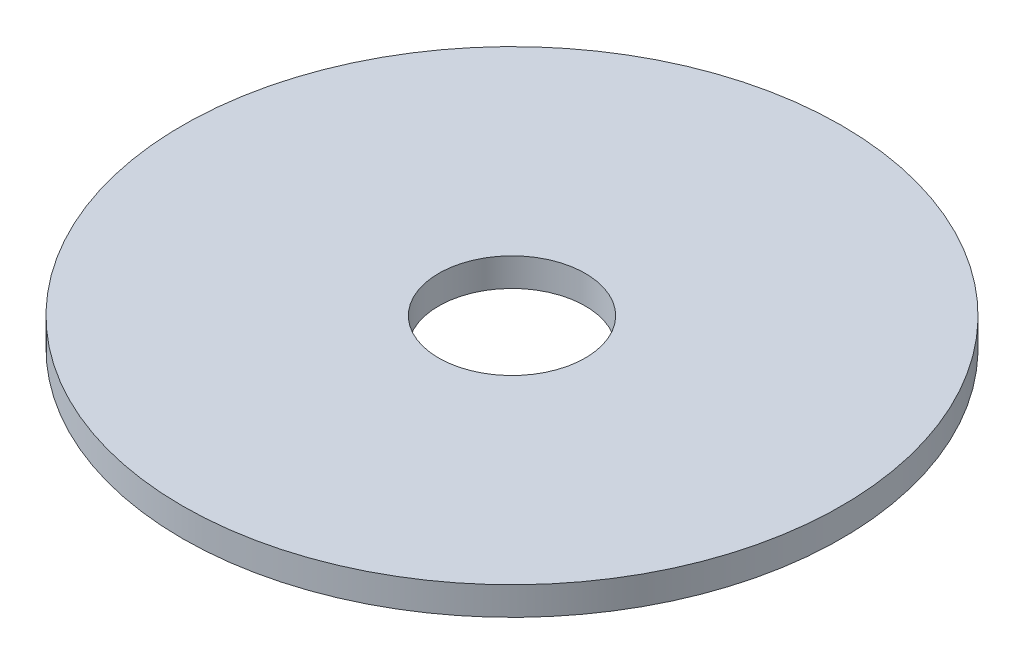
ISO-10303-21;
HEADER;
FILE_DESCRIPTION(('STEP AP214'),'2;1');
FILE_NAME('part.step','',(''),(''),'','','');
FILE_SCHEMA(('AUTOMOTIVE_DESIGN { 1 0 10303 214 1 1 1 1 }'));
ENDSEC;
DATA;
#1=APPLICATION_CONTEXT('core data for automotive mechanical design processes');
#2=APPLICATION_PROTOCOL_DEFINITION('international standard','automotive_design',2000,#1);
#3=PRODUCT_CONTEXT('',#1,'mechanical');
#4=PRODUCT('Part','Part','',(#3));
#5=PRODUCT_RELATED_PRODUCT_CATEGORY('part','',(#4));
#6=PRODUCT_DEFINITION_FORMATION('','',#4);
#7=PRODUCT_DEFINITION_CONTEXT('part definition',#1,'design');
#8=PRODUCT_DEFINITION('design','',#6,#7);
#9=PRODUCT_DEFINITION_SHAPE('','',#8);
#10=(LENGTH_UNIT() NAMED_UNIT(*) SI_UNIT(.MILLI.,.METRE.));
#11=(NAMED_UNIT(*) PLANE_ANGLE_UNIT() SI_UNIT($,.RADIAN.));
#12=(NAMED_UNIT(*) SI_UNIT($,.STERADIAN.) SOLID_ANGLE_UNIT());
#13=UNCERTAINTY_MEASURE_WITH_UNIT(LENGTH_MEASURE(1.E-05),#10,'distance_accuracy_value','');
#14=(GEOMETRIC_REPRESENTATION_CONTEXT(3) GLOBAL_UNCERTAINTY_ASSIGNED_CONTEXT((#13)) GLOBAL_UNIT_ASSIGNED_CONTEXT((#10,
#11,#12)) REPRESENTATION_CONTEXT('',''));
#15=CARTESIAN_POINT('',(0.,0.,0.));
#16=DIRECTION('',(0.,0.,1.));
#17=DIRECTION('',(1.,0.,0.));
#18=AXIS2_PLACEMENT_3D('',#15,#16,#17);
#19=CARTESIAN_POINT('',(0.,8.8,0.));
#20=DIRECTION('',(0.,1.,0.));
#21=DIRECTION('',(0.,0.,1.));
#22=AXIS2_PLACEMENT_3D('',#19,#20,#21);
#23=PLANE('',#22);
#24=CARTESIAN_POINT('',(0.,8.8,0.));
#25=DIRECTION('',(0.,1.,0.));
#26=DIRECTION('',(0.,0.,1.));
#27=AXIS2_PLACEMENT_3D('',#24,#25,#26);
#28=CIRCLE('',#27,18.65);
#29=CARTESIAN_POINT('',(0.,8.8,18.65));
#30=VERTEX_POINT('',#29);
#31=EDGE_CURVE('E10',#30,#30,#28,.T.);
#32=ORIENTED_EDGE('',*,*,#31,.T.);
#33=EDGE_LOOP('',(#32));
#34=FACE_BOUND('',#33,.T.);
#35=CARTESIAN_POINT('',(0.,8.8,0.));
#36=DIRECTION('',(0.,1.,0.));
#37=DIRECTION('',(0.,0.,1.));
#38=AXIS2_PLACEMENT_3D('',#35,#36,#37);
#39=CIRCLE('',#38,4.15);
#40=CARTESIAN_POINT('',(0.,8.8,4.15));
#41=VERTEX_POINT('',#40);
#42=EDGE_CURVE('E44',#41,#41,#39,.T.);
#43=ORIENTED_EDGE('',*,*,#42,.F.);
#44=EDGE_LOOP('',(#43));
#45=FACE_BOUND('',#44,.T.);
#46=ADVANCED_FACE('F33',(#34,#45),#23,.T.);
#47=CARTESIAN_POINT('',(0.,7.2,0.));
#48=DIRECTION('',(0.,1.,0.));
#49=DIRECTION('',(0.,0.,1.));
#50=AXIS2_PLACEMENT_3D('',#47,#48,#49);
#51=PLANE('',#50);
#52=CARTESIAN_POINT('',(0.,7.2,0.));
#53=DIRECTION('',(0.,1.,0.));
#54=DIRECTION('',(0.,0.,1.));
#55=AXIS2_PLACEMENT_3D('',#52,#53,#54);
#56=CIRCLE('',#55,18.65);
#57=CARTESIAN_POINT('',(0.,7.2,18.65));
#58=VERTEX_POINT('',#57);
#59=EDGE_CURVE('E37',#58,#58,#56,.T.);
#60=ORIENTED_EDGE('',*,*,#59,.F.);
#61=EDGE_LOOP('',(#60));
#62=FACE_BOUND('',#61,.T.);
#63=CARTESIAN_POINT('',(0.,7.2,0.));
#64=DIRECTION('',(0.,1.,0.));
#65=DIRECTION('',(0.,0.,1.));
#66=AXIS2_PLACEMENT_3D('',#63,#64,#65);
#67=CIRCLE('',#66,4.15);
#68=CARTESIAN_POINT('',(0.,7.2,4.15));
#69=VERTEX_POINT('',#68);
#70=EDGE_CURVE('E46',#69,#69,#67,.T.);
#71=ORIENTED_EDGE('',*,*,#70,.T.);
#72=EDGE_LOOP('',(#71));
#73=FACE_BOUND('',#72,.T.);
#74=ADVANCED_FACE('F56',(#62,#73),#51,.F.);
#75=CARTESIAN_POINT('',(0.,8.8,0.));
#76=DIRECTION('',(0.,-1.,0.));
#77=DIRECTION('',(0.,0.,-1.));
#78=AXIS2_PLACEMENT_3D('',#75,#76,#77);
#79=CYLINDRICAL_SURFACE('',#78,18.65);
#80=ORIENTED_EDGE('',*,*,#31,.F.);
#81=EDGE_LOOP('',(#80));
#82=FACE_BOUND('',#81,.T.);
#83=ORIENTED_EDGE('',*,*,#59,.T.);
#84=EDGE_LOOP('',(#83));
#85=FACE_BOUND('',#84,.T.);
#86=ADVANCED_FACE('F35',(#82,#85),#79,.T.);
#87=CARTESIAN_POINT('',(0.,8.8,0.));
#88=DIRECTION('',(0.,-1.,0.));
#89=DIRECTION('',(0.,0.,-1.));
#90=AXIS2_PLACEMENT_3D('',#87,#88,#89);
#91=CYLINDRICAL_SURFACE('',#90,4.15);
#92=ORIENTED_EDGE('',*,*,#42,.T.);
#93=EDGE_LOOP('',(#92));
#94=FACE_BOUND('',#93,.T.);
#95=ORIENTED_EDGE('',*,*,#70,.F.);
#96=EDGE_LOOP('',(#95));
#97=FACE_BOUND('',#96,.T.);
#98=ADVANCED_FACE('F52',(#94,#97),#91,.F.);
#99=CLOSED_SHELL('',(#46,#74,#86,#98));
#100=MANIFOLD_SOLID_BREP('B2',#99);
#101=ADVANCED_BREP_SHAPE_REPRESENTATION('',(#18,#100),#14);
#102=SHAPE_DEFINITION_REPRESENTATION(#9,#101);
ENDSEC;
END-ISO-10303-21;
